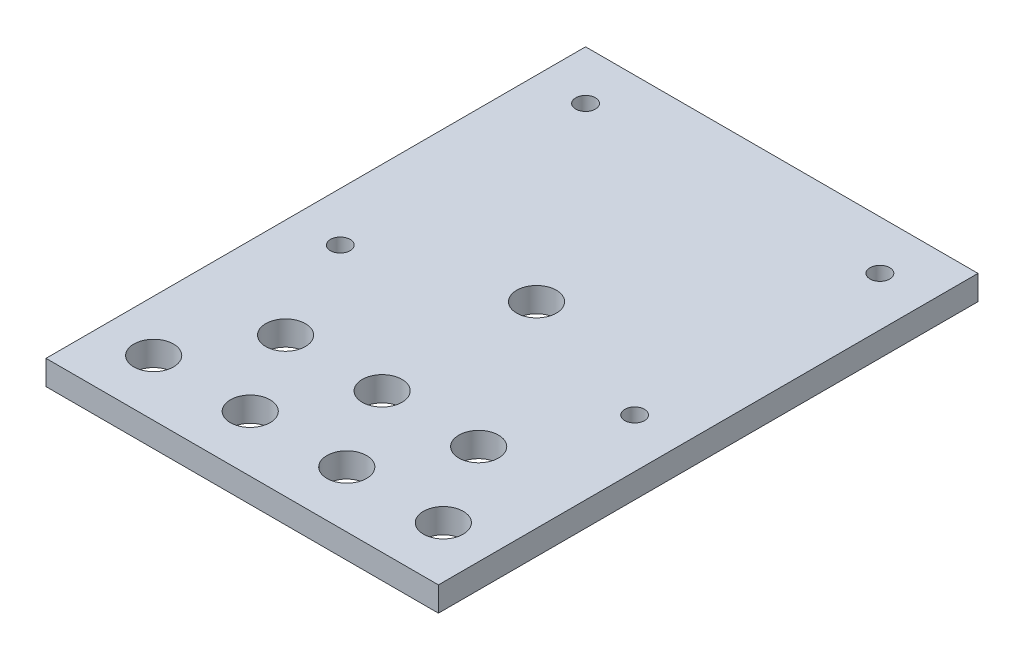
ISO-10303-21;
HEADER;
FILE_DESCRIPTION(('STEP AP214'),'2;1');
FILE_NAME('part.step','',(''),(''),'','','');
FILE_SCHEMA(('AUTOMOTIVE_DESIGN { 1 0 10303 214 1 1 1 1 }'));
ENDSEC;
DATA;
#1=APPLICATION_CONTEXT('core data for automotive mechanical design processes');
#2=APPLICATION_PROTOCOL_DEFINITION('international standard','automotive_design',2000,#1);
#3=PRODUCT_CONTEXT('',#1,'mechanical');
#4=PRODUCT('Part','Part','',(#3));
#5=PRODUCT_RELATED_PRODUCT_CATEGORY('part','',(#4));
#6=PRODUCT_DEFINITION_FORMATION('','',#4);
#7=PRODUCT_DEFINITION_CONTEXT('part definition',#1,'design');
#8=PRODUCT_DEFINITION('design','',#6,#7);
#9=PRODUCT_DEFINITION_SHAPE('','',#8);
#10=(LENGTH_UNIT() NAMED_UNIT(*) SI_UNIT(.MILLI.,.METRE.));
#11=(NAMED_UNIT(*) PLANE_ANGLE_UNIT() SI_UNIT($,.RADIAN.));
#12=(NAMED_UNIT(*) SI_UNIT($,.STERADIAN.) SOLID_ANGLE_UNIT());
#13=UNCERTAINTY_MEASURE_WITH_UNIT(LENGTH_MEASURE(1.E-05),#10,'distance_accuracy_value','');
#14=(GEOMETRIC_REPRESENTATION_CONTEXT(3) GLOBAL_UNCERTAINTY_ASSIGNED_CONTEXT((#13)) GLOBAL_UNIT_ASSIGNED_CONTEXT((#10,
#11,#12)) REPRESENTATION_CONTEXT('',''));
#15=CARTESIAN_POINT('',(0.,0.,0.));
#16=DIRECTION('',(0.,0.,1.));
#17=DIRECTION('',(1.,0.,0.));
#18=AXIS2_PLACEMENT_3D('',#15,#16,#17);
#19=CARTESIAN_POINT('',(0.,6.35,0.));
#20=DIRECTION('',(1.,0.,0.));
#21=DIRECTION('',(0.,0.,-1.));
#22=AXIS2_PLACEMENT_3D('',#19,#20,#21);
#23=PLANE('',#22);
#24=DIRECTION('',(0.,0.,1.));
#25=VECTOR('',#24,1.);
#26=CARTESIAN_POINT('',(0.,0.,0.));
#27=LINE('',#26,#25);
#28=CARTESIAN_POINT('',(0.,0.,-139.7));
#29=VERTEX_POINT('',#28);
#30=CARTESIAN_POINT('',(0.,0.,0.));
#31=VERTEX_POINT('',#30);
#32=EDGE_CURVE('E100',#29,#31,#27,.T.);
#33=ORIENTED_EDGE('',*,*,#32,.T.);
#34=DIRECTION('',(0.,-1.,0.));
#35=VECTOR('',#34,1.);
#36=CARTESIAN_POINT('',(0.,6.35,0.));
#37=LINE('',#36,#35);
#38=CARTESIAN_POINT('',(0.,6.35,0.));
#39=VERTEX_POINT('',#38);
#40=EDGE_CURVE('E11',#39,#31,#37,.T.);
#41=ORIENTED_EDGE('',*,*,#40,.F.);
#42=DIRECTION('',(0.,0.,1.));
#43=VECTOR('',#42,1.);
#44=CARTESIAN_POINT('',(0.,6.35,0.));
#45=LINE('',#44,#43);
#46=CARTESIAN_POINT('',(0.,6.35,-139.7));
#47=VERTEX_POINT('',#46);
#48=EDGE_CURVE('E88',#47,#39,#45,.T.);
#49=ORIENTED_EDGE('',*,*,#48,.F.);
#50=DIRECTION('',(0.,-1.,0.));
#51=VECTOR('',#50,1.);
#52=CARTESIAN_POINT('',(0.,6.35,-139.7));
#53=LINE('',#52,#51);
#54=EDGE_CURVE('E96',#47,#29,#53,.T.);
#55=ORIENTED_EDGE('',*,*,#54,.T.);
#56=EDGE_LOOP('',(#33,#41,#49,#55));
#57=FACE_BOUND('',#56,.T.);
#58=ADVANCED_FACE('F37',(#57),#23,.F.);
#59=CARTESIAN_POINT('',(0.,6.35,0.));
#60=DIRECTION('',(0.,0.,-1.));
#61=DIRECTION('',(-1.,0.,0.));
#62=AXIS2_PLACEMENT_3D('',#59,#60,#61);
#63=PLANE('',#62);
#64=DIRECTION('',(1.,0.,0.));
#65=VECTOR('',#64,1.);
#66=CARTESIAN_POINT('',(0.,0.,0.));
#67=LINE('',#66,#65);
#68=CARTESIAN_POINT('',(101.6,0.,0.));
#69=VERTEX_POINT('',#68);
#70=EDGE_CURVE('E92',#31,#69,#67,.T.);
#71=ORIENTED_EDGE('',*,*,#70,.T.);
#72=DIRECTION('',(0.,-1.,0.));
#73=VECTOR('',#72,1.);
#74=CARTESIAN_POINT('',(101.6,6.35,0.));
#75=LINE('',#74,#73);
#76=CARTESIAN_POINT('',(101.6,6.35,0.));
#77=VERTEX_POINT('',#76);
#78=EDGE_CURVE('E45',#77,#69,#75,.T.);
#79=ORIENTED_EDGE('',*,*,#78,.F.);
#80=DIRECTION('',(1.,0.,0.));
#81=VECTOR('',#80,1.);
#82=CARTESIAN_POINT('',(0.,6.35,0.));
#83=LINE('',#82,#81);
#84=EDGE_CURVE('E83',#39,#77,#83,.T.);
#85=ORIENTED_EDGE('',*,*,#84,.F.);
#86=ORIENTED_EDGE('',*,*,#40,.T.);
#87=EDGE_LOOP('',(#71,#79,#85,#86));
#88=FACE_BOUND('',#87,.T.);
#89=ADVANCED_FACE('F91',(#88),#63,.F.);
#90=CARTESIAN_POINT('',(101.6,6.35,0.));
#91=DIRECTION('',(-1.,0.,0.));
#92=DIRECTION('',(0.,0.,1.));
#93=AXIS2_PLACEMENT_3D('',#90,#91,#92);
#94=PLANE('',#93);
#95=DIRECTION('',(0.,0.,-1.));
#96=VECTOR('',#95,1.);
#97=CARTESIAN_POINT('',(101.6,0.,0.));
#98=LINE('',#97,#96);
#99=CARTESIAN_POINT('',(101.6,0.,-139.7));
#100=VERTEX_POINT('',#99);
#101=EDGE_CURVE('E70',#69,#100,#98,.T.);
#102=ORIENTED_EDGE('',*,*,#101,.T.);
#103=DIRECTION('',(0.,-1.,0.));
#104=VECTOR('',#103,1.);
#105=CARTESIAN_POINT('',(101.6,6.35,-139.7));
#106=LINE('',#105,#104);
#107=CARTESIAN_POINT('',(101.6,6.35,-139.7));
#108=VERTEX_POINT('',#107);
#109=EDGE_CURVE('E93',#108,#100,#106,.T.);
#110=ORIENTED_EDGE('',*,*,#109,.F.);
#111=DIRECTION('',(0.,0.,-1.));
#112=VECTOR('',#111,1.);
#113=CARTESIAN_POINT('',(101.6,6.35,0.));
#114=LINE('',#113,#112);
#115=EDGE_CURVE('E86',#77,#108,#114,.T.);
#116=ORIENTED_EDGE('',*,*,#115,.F.);
#117=ORIENTED_EDGE('',*,*,#78,.T.);
#118=EDGE_LOOP('',(#102,#110,#116,#117));
#119=FACE_BOUND('',#118,.T.);
#120=ADVANCED_FACE('F94',(#119),#94,.F.);
#121=CARTESIAN_POINT('',(0.,6.35,-139.7));
#122=DIRECTION('',(0.,0.,1.));
#123=DIRECTION('',(1.,0.,0.));
#124=AXIS2_PLACEMENT_3D('',#121,#122,#123);
#125=PLANE('',#124);
#126=DIRECTION('',(-1.,0.,0.));
#127=VECTOR('',#126,1.);
#128=CARTESIAN_POINT('',(0.,0.,-139.7));
#129=LINE('',#128,#127);
#130=EDGE_CURVE('E76',#100,#29,#129,.T.);
#131=ORIENTED_EDGE('',*,*,#130,.T.);
#132=ORIENTED_EDGE('',*,*,#54,.F.);
#133=DIRECTION('',(-1.,0.,0.));
#134=VECTOR('',#133,1.);
#135=CARTESIAN_POINT('',(0.,6.35,-139.7));
#136=LINE('',#135,#134);
#137=EDGE_CURVE('E53',#108,#47,#136,.T.);
#138=ORIENTED_EDGE('',*,*,#137,.F.);
#139=ORIENTED_EDGE('',*,*,#109,.T.);
#140=EDGE_LOOP('',(#131,#132,#138,#139));
#141=FACE_BOUND('',#140,.T.);
#142=ADVANCED_FACE('F108',(#141),#125,.F.);
#143=CARTESIAN_POINT('',(0.,6.35,0.));
#144=DIRECTION('',(0.,-1.,0.));
#145=DIRECTION('',(0.,0.,-1.));
#146=AXIS2_PLACEMENT_3D('',#143,#144,#145);
#147=PLANE('',#146);
#148=CARTESIAN_POINT('',(12.7,6.35,-127.));
#149=DIRECTION('',(0.,1.,0.));
#150=DIRECTION('',(0.,0.,1.));
#151=AXIS2_PLACEMENT_3D('',#148,#149,#150);
#152=CIRCLE('',#151,2.55);
#153=CARTESIAN_POINT('',(12.7,6.35,-124.45));
#154=VERTEX_POINT('',#153);
#155=EDGE_CURVE('E144',#154,#154,#152,.T.);
#156=ORIENTED_EDGE('',*,*,#155,.F.);
#157=EDGE_LOOP('',(#156));
#158=FACE_BOUND('',#157,.T.);
#159=CARTESIAN_POINT('',(12.7,6.35,-63.5));
#160=DIRECTION('',(0.,1.,0.));
#161=DIRECTION('',(0.,0.,1.));
#162=AXIS2_PLACEMENT_3D('',#159,#160,#161);
#163=CIRCLE('',#162,2.55);
#164=CARTESIAN_POINT('',(12.7,6.35,-60.95));
#165=VERTEX_POINT('',#164);
#166=EDGE_CURVE('E151',#165,#165,#163,.T.);
#167=ORIENTED_EDGE('',*,*,#166,.F.);
#168=EDGE_LOOP('',(#167));
#169=FACE_BOUND('',#168,.T.);
#170=CARTESIAN_POINT('',(25.8,6.35,-36.2253175473051));
#171=DIRECTION('',(0.,1.,0.));
#172=DIRECTION('',(0.,0.,1.));
#173=AXIS2_PLACEMENT_3D('',#170,#171,#172);
#174=CIRCLE('',#173,5.1435);
#175=CARTESIAN_POINT('',(25.8,6.35,-31.0818175473051));
#176=VERTEX_POINT('',#175);
#177=EDGE_CURVE('E157',#176,#176,#174,.T.);
#178=ORIENTED_EDGE('',*,*,#177,.F.);
#179=EDGE_LOOP('',(#178));
#180=FACE_BOUND('',#179,.T.);
#181=CARTESIAN_POINT('',(50.8,6.35,-36.2253175473055));
#182=DIRECTION('',(0.,1.,0.));
#183=DIRECTION('',(0.,0.,1.));
#184=AXIS2_PLACEMENT_3D('',#181,#182,#183);
#185=CIRCLE('',#184,5.14350000000001);
#186=CARTESIAN_POINT('',(50.8,6.35,-31.0818175473055));
#187=VERTEX_POINT('',#186);
#188=EDGE_CURVE('E163',#187,#187,#185,.T.);
#189=ORIENTED_EDGE('',*,*,#188,.F.);
#190=EDGE_LOOP('',(#189));
#191=FACE_BOUND('',#190,.T.);
#192=CARTESIAN_POINT('',(75.8,6.35,-36.2253175473055));
#193=DIRECTION('',(0.,1.,0.));
#194=DIRECTION('',(0.,0.,1.));
#195=AXIS2_PLACEMENT_3D('',#192,#193,#194);
#196=CIRCLE('',#195,5.1435);
#197=CARTESIAN_POINT('',(75.8,6.35,-31.0818175473055));
#198=VERTEX_POINT('',#197);
#199=EDGE_CURVE('E120',#198,#198,#196,.T.);
#200=ORIENTED_EDGE('',*,*,#199,.F.);
#201=EDGE_LOOP('',(#200));
#202=FACE_BOUND('',#201,.T.);
#203=CARTESIAN_POINT('',(88.3,6.35,-14.5746824526945));
#204=DIRECTION('',(0.,1.,0.));
#205=DIRECTION('',(0.,0.,1.));
#206=AXIS2_PLACEMENT_3D('',#203,#204,#205);
#207=CIRCLE('',#206,5.1435);
#208=CARTESIAN_POINT('',(88.3,6.35,-9.43118245269453));
#209=VERTEX_POINT('',#208);
#210=EDGE_CURVE('E127',#209,#209,#207,.T.);
#211=ORIENTED_EDGE('',*,*,#210,.F.);
#212=EDGE_LOOP('',(#211));
#213=FACE_BOUND('',#212,.T.);
#214=CARTESIAN_POINT('',(63.3,6.35,-14.5746824526945));
#215=DIRECTION('',(0.,1.,0.));
#216=DIRECTION('',(0.,0.,1.));
#217=AXIS2_PLACEMENT_3D('',#214,#215,#216);
#218=CIRCLE('',#217,5.1435);
#219=CARTESIAN_POINT('',(63.3,6.35,-9.43118245269453));
#220=VERTEX_POINT('',#219);
#221=EDGE_CURVE('E133',#220,#220,#218,.T.);
#222=ORIENTED_EDGE('',*,*,#221,.F.);
#223=EDGE_LOOP('',(#222));
#224=FACE_BOUND('',#223,.T.);
#225=CARTESIAN_POINT('',(38.3,6.35,-14.5746824526945));
#226=DIRECTION('',(0.,1.,0.));
#227=DIRECTION('',(0.,0.,1.));
#228=AXIS2_PLACEMENT_3D('',#225,#226,#227);
#229=CIRCLE('',#228,5.14350000000001);
#230=CARTESIAN_POINT('',(38.3,6.35,-9.43118245269452));
#231=VERTEX_POINT('',#230);
#232=EDGE_CURVE('E139',#231,#231,#229,.T.);
#233=ORIENTED_EDGE('',*,*,#232,.F.);
#234=EDGE_LOOP('',(#233));
#235=FACE_BOUND('',#234,.T.);
#236=CARTESIAN_POINT('',(88.9,6.35,-63.5));
#237=DIRECTION('',(0.,1.,0.));
#238=DIRECTION('',(0.,0.,1.));
#239=AXIS2_PLACEMENT_3D('',#236,#237,#238);
#240=CIRCLE('',#239,2.54999999999999);
#241=CARTESIAN_POINT('',(88.9,6.35,-60.95));
#242=VERTEX_POINT('',#241);
#243=EDGE_CURVE('E180',#242,#242,#240,.T.);
#244=ORIENTED_EDGE('',*,*,#243,.F.);
#245=EDGE_LOOP('',(#244));
#246=FACE_BOUND('',#245,.T.);
#247=CARTESIAN_POINT('',(88.9,6.35,-127.));
#248=DIRECTION('',(0.,1.,0.));
#249=DIRECTION('',(0.,0.,1.));
#250=AXIS2_PLACEMENT_3D('',#247,#248,#249);
#251=CIRCLE('',#250,2.54999999999999);
#252=CARTESIAN_POINT('',(88.9,6.35,-124.45));
#253=VERTEX_POINT('',#252);
#254=EDGE_CURVE('E174',#253,#253,#251,.T.);
#255=ORIENTED_EDGE('',*,*,#254,.F.);
#256=EDGE_LOOP('',(#255));
#257=FACE_BOUND('',#256,.T.);
#258=CARTESIAN_POINT('',(50.8,6.35,-76.1999999999997));
#259=DIRECTION('',(0.,1.,0.));
#260=DIRECTION('',(0.,0.,1.));
#261=AXIS2_PLACEMENT_3D('',#258,#259,#260);
#262=CIRCLE('',#261,5.14350000000008);
#263=CARTESIAN_POINT('',(50.8,6.35,-71.0564999999997));
#264=VERTEX_POINT('',#263);
#265=EDGE_CURVE('E168',#264,#264,#262,.T.);
#266=ORIENTED_EDGE('',*,*,#265,.F.);
#267=EDGE_LOOP('',(#266));
#268=FACE_BOUND('',#267,.T.);
#269=CARTESIAN_POINT('',(13.3,6.35,-14.5746824526945));
#270=DIRECTION('',(0.,1.,0.));
#271=DIRECTION('',(0.,0.,1.));
#272=AXIS2_PLACEMENT_3D('',#269,#270,#271);
#273=CIRCLE('',#272,5.1435);
#274=CARTESIAN_POINT('',(13.3,6.35,-9.43118245269452));
#275=VERTEX_POINT('',#274);
#276=EDGE_CURVE('E114',#275,#275,#273,.T.);
#277=ORIENTED_EDGE('',*,*,#276,.F.);
#278=EDGE_LOOP('',(#277));
#279=FACE_BOUND('',#278,.T.);
#280=ORIENTED_EDGE('',*,*,#48,.T.);
#281=ORIENTED_EDGE('',*,*,#84,.T.);
#282=ORIENTED_EDGE('',*,*,#115,.T.);
#283=ORIENTED_EDGE('',*,*,#137,.T.);
#284=EDGE_LOOP('',(#280,#281,#282,#283));
#285=FACE_BOUND('',#284,.T.);
#286=ADVANCED_FACE('F84',(#158,#169,#180,#191,#202,#213,#224,#235,#246,#257,#268,#279,#285),
#147,.F.);
#287=CARTESIAN_POINT('',(0.,0.,0.));
#288=DIRECTION('',(0.,-1.,0.));
#289=DIRECTION('',(0.,0.,-1.));
#290=AXIS2_PLACEMENT_3D('',#287,#288,#289);
#291=PLANE('',#290);
#292=CARTESIAN_POINT('',(12.7,0.,-127.));
#293=DIRECTION('',(0.,1.,0.));
#294=DIRECTION('',(0.,0.,1.));
#295=AXIS2_PLACEMENT_3D('',#292,#293,#294);
#296=CIRCLE('',#295,2.55);
#297=CARTESIAN_POINT('',(12.7,0.,-124.45));
#298=VERTEX_POINT('',#297);
#299=EDGE_CURVE('E147',#298,#298,#296,.T.);
#300=ORIENTED_EDGE('',*,*,#299,.T.);
#301=EDGE_LOOP('',(#300));
#302=FACE_BOUND('',#301,.T.);
#303=CARTESIAN_POINT('',(12.7,0.,-63.5));
#304=DIRECTION('',(0.,1.,0.));
#305=DIRECTION('',(0.,0.,1.));
#306=AXIS2_PLACEMENT_3D('',#303,#304,#305);
#307=CIRCLE('',#306,2.55);
#308=CARTESIAN_POINT('',(12.7,0.,-60.95));
#309=VERTEX_POINT('',#308);
#310=EDGE_CURVE('E154',#309,#309,#307,.T.);
#311=ORIENTED_EDGE('',*,*,#310,.T.);
#312=EDGE_LOOP('',(#311));
#313=FACE_BOUND('',#312,.T.);
#314=CARTESIAN_POINT('',(25.8,0.,-36.2253175473051));
#315=DIRECTION('',(0.,1.,0.));
#316=DIRECTION('',(0.,0.,1.));
#317=AXIS2_PLACEMENT_3D('',#314,#315,#316);
#318=CIRCLE('',#317,5.1435);
#319=CARTESIAN_POINT('',(25.8,0.,-31.0818175473051));
#320=VERTEX_POINT('',#319);
#321=EDGE_CURVE('E160',#320,#320,#318,.T.);
#322=ORIENTED_EDGE('',*,*,#321,.T.);
#323=EDGE_LOOP('',(#322));
#324=FACE_BOUND('',#323,.T.);
#325=CARTESIAN_POINT('',(50.8,0.,-36.2253175473055));
#326=DIRECTION('',(0.,1.,0.));
#327=DIRECTION('',(0.,0.,1.));
#328=AXIS2_PLACEMENT_3D('',#325,#326,#327);
#329=CIRCLE('',#328,5.14350000000001);
#330=CARTESIAN_POINT('',(50.8,0.,-31.0818175473055));
#331=VERTEX_POINT('',#330);
#332=EDGE_CURVE('E124',#331,#331,#329,.T.);
#333=ORIENTED_EDGE('',*,*,#332,.T.);
#334=EDGE_LOOP('',(#333));
#335=FACE_BOUND('',#334,.T.);
#336=CARTESIAN_POINT('',(75.8,0.,-36.2253175473055));
#337=DIRECTION('',(0.,1.,0.));
#338=DIRECTION('',(0.,0.,1.));
#339=AXIS2_PLACEMENT_3D('',#336,#337,#338);
#340=CIRCLE('',#339,5.1435);
#341=CARTESIAN_POINT('',(75.8,0.,-31.0818175473055));
#342=VERTEX_POINT('',#341);
#343=EDGE_CURVE('E123',#342,#342,#340,.T.);
#344=ORIENTED_EDGE('',*,*,#343,.T.);
#345=EDGE_LOOP('',(#344));
#346=FACE_BOUND('',#345,.T.);
#347=CARTESIAN_POINT('',(88.3,0.,-14.5746824526945));
#348=DIRECTION('',(0.,1.,0.));
#349=DIRECTION('',(0.,0.,1.));
#350=AXIS2_PLACEMENT_3D('',#347,#348,#349);
#351=CIRCLE('',#350,5.1435);
#352=CARTESIAN_POINT('',(88.3,0.,-9.43118245269453));
#353=VERTEX_POINT('',#352);
#354=EDGE_CURVE('E130',#353,#353,#351,.T.);
#355=ORIENTED_EDGE('',*,*,#354,.T.);
#356=EDGE_LOOP('',(#355));
#357=FACE_BOUND('',#356,.T.);
#358=CARTESIAN_POINT('',(63.3,0.,-14.5746824526945));
#359=DIRECTION('',(0.,1.,0.));
#360=DIRECTION('',(0.,0.,1.));
#361=AXIS2_PLACEMENT_3D('',#358,#359,#360);
#362=CIRCLE('',#361,5.1435);
#363=CARTESIAN_POINT('',(63.3,0.,-9.43118245269453));
#364=VERTEX_POINT('',#363);
#365=EDGE_CURVE('E136',#364,#364,#362,.T.);
#366=ORIENTED_EDGE('',*,*,#365,.T.);
#367=EDGE_LOOP('',(#366));
#368=FACE_BOUND('',#367,.T.);
#369=CARTESIAN_POINT('',(38.3,0.,-14.5746824526945));
#370=DIRECTION('',(0.,1.,0.));
#371=DIRECTION('',(0.,0.,1.));
#372=AXIS2_PLACEMENT_3D('',#369,#370,#371);
#373=CIRCLE('',#372,5.14350000000001);
#374=CARTESIAN_POINT('',(38.3,0.,-9.43118245269452));
#375=VERTEX_POINT('',#374);
#376=EDGE_CURVE('E117',#375,#375,#373,.T.);
#377=ORIENTED_EDGE('',*,*,#376,.T.);
#378=EDGE_LOOP('',(#377));
#379=FACE_BOUND('',#378,.T.);
#380=CARTESIAN_POINT('',(88.9,0.,-63.5));
#381=DIRECTION('',(0.,1.,0.));
#382=DIRECTION('',(0.,0.,1.));
#383=AXIS2_PLACEMENT_3D('',#380,#381,#382);
#384=CIRCLE('',#383,2.54999999999999);
#385=CARTESIAN_POINT('',(88.9,0.,-60.95));
#386=VERTEX_POINT('',#385);
#387=EDGE_CURVE('E148',#386,#386,#384,.T.);
#388=ORIENTED_EDGE('',*,*,#387,.T.);
#389=EDGE_LOOP('',(#388));
#390=FACE_BOUND('',#389,.T.);
#391=CARTESIAN_POINT('',(88.9,0.,-127.));
#392=DIRECTION('',(0.,1.,0.));
#393=DIRECTION('',(0.,0.,1.));
#394=AXIS2_PLACEMENT_3D('',#391,#392,#393);
#395=CIRCLE('',#394,2.54999999999999);
#396=CARTESIAN_POINT('',(88.9,0.,-124.45));
#397=VERTEX_POINT('',#396);
#398=EDGE_CURVE('E177',#397,#397,#395,.T.);
#399=ORIENTED_EDGE('',*,*,#398,.T.);
#400=EDGE_LOOP('',(#399));
#401=FACE_BOUND('',#400,.T.);
#402=CARTESIAN_POINT('',(50.8,0.,-76.1999999999997));
#403=DIRECTION('',(0.,1.,0.));
#404=DIRECTION('',(0.,0.,1.));
#405=AXIS2_PLACEMENT_3D('',#402,#403,#404);
#406=CIRCLE('',#405,5.14350000000008);
#407=CARTESIAN_POINT('',(50.8,0.,-71.0564999999997));
#408=VERTEX_POINT('',#407);
#409=EDGE_CURVE('E171',#408,#408,#406,.T.);
#410=ORIENTED_EDGE('',*,*,#409,.T.);
#411=EDGE_LOOP('',(#410));
#412=FACE_BOUND('',#411,.T.);
#413=CARTESIAN_POINT('',(13.3,0.,-14.5746824526945));
#414=DIRECTION('',(0.,1.,0.));
#415=DIRECTION('',(0.,0.,1.));
#416=AXIS2_PLACEMENT_3D('',#413,#414,#415);
#417=CIRCLE('',#416,5.1435);
#418=CARTESIAN_POINT('',(13.3,0.,-9.43118245269452));
#419=VERTEX_POINT('',#418);
#420=EDGE_CURVE('E103',#419,#419,#417,.T.);
#421=ORIENTED_EDGE('',*,*,#420,.T.);
#422=EDGE_LOOP('',(#421));
#423=FACE_BOUND('',#422,.T.);
#424=ORIENTED_EDGE('',*,*,#32,.F.);
#425=ORIENTED_EDGE('',*,*,#130,.F.);
#426=ORIENTED_EDGE('',*,*,#101,.F.);
#427=ORIENTED_EDGE('',*,*,#70,.F.);
#428=EDGE_LOOP('',(#424,#425,#426,#427));
#429=FACE_BOUND('',#428,.T.);
#430=ADVANCED_FACE('F111',(#302,#313,#324,#335,#346,#357,#368,#379,#390,#401,#412,#423,#429),
#291,.T.);
#431=CARTESIAN_POINT('',(13.3,0.,-14.5746824526945));
#432=DIRECTION('',(0.,1.,0.));
#433=DIRECTION('',(0.,0.,1.));
#434=AXIS2_PLACEMENT_3D('',#431,#432,#433);
#435=CYLINDRICAL_SURFACE('',#434,5.1435);
#436=ORIENTED_EDGE('',*,*,#420,.F.);
#437=EDGE_LOOP('',(#436));
#438=FACE_BOUND('',#437,.T.);
#439=ORIENTED_EDGE('',*,*,#276,.T.);
#440=EDGE_LOOP('',(#439));
#441=FACE_BOUND('',#440,.T.);
#442=ADVANCED_FACE('F206',(#438,#441),#435,.F.);
#443=CARTESIAN_POINT('',(50.8,0.,-76.1999999999997));
#444=DIRECTION('',(0.,1.,0.));
#445=DIRECTION('',(0.,0.,1.));
#446=AXIS2_PLACEMENT_3D('',#443,#444,#445);
#447=CYLINDRICAL_SURFACE('',#446,5.14350000000008);
#448=ORIENTED_EDGE('',*,*,#409,.F.);
#449=EDGE_LOOP('',(#448));
#450=FACE_BOUND('',#449,.T.);
#451=ORIENTED_EDGE('',*,*,#265,.T.);
#452=EDGE_LOOP('',(#451));
#453=FACE_BOUND('',#452,.T.);
#454=ADVANCED_FACE('F208',(#450,#453),#447,.F.);
#455=CARTESIAN_POINT('',(88.9,0.,-127.));
#456=DIRECTION('',(0.,1.,0.));
#457=DIRECTION('',(0.,0.,1.));
#458=AXIS2_PLACEMENT_3D('',#455,#456,#457);
#459=CYLINDRICAL_SURFACE('',#458,2.54999999999999);
#460=ORIENTED_EDGE('',*,*,#398,.F.);
#461=EDGE_LOOP('',(#460));
#462=FACE_BOUND('',#461,.T.);
#463=ORIENTED_EDGE('',*,*,#254,.T.);
#464=EDGE_LOOP('',(#463));
#465=FACE_BOUND('',#464,.T.);
#466=ADVANCED_FACE('F192',(#462,#465),#459,.F.);
#467=CARTESIAN_POINT('',(88.9,0.,-63.5));
#468=DIRECTION('',(0.,1.,0.));
#469=DIRECTION('',(0.,0.,1.));
#470=AXIS2_PLACEMENT_3D('',#467,#468,#469);
#471=CYLINDRICAL_SURFACE('',#470,2.54999999999999);
#472=ORIENTED_EDGE('',*,*,#387,.F.);
#473=EDGE_LOOP('',(#472));
#474=FACE_BOUND('',#473,.T.);
#475=ORIENTED_EDGE('',*,*,#243,.T.);
#476=EDGE_LOOP('',(#475));
#477=FACE_BOUND('',#476,.T.);
#478=ADVANCED_FACE('F188',(#474,#477),#471,.F.);
#479=CARTESIAN_POINT('',(38.3,0.,-14.5746824526945));
#480=DIRECTION('',(0.,1.,0.));
#481=DIRECTION('',(0.,0.,1.));
#482=AXIS2_PLACEMENT_3D('',#479,#480,#481);
#483=CYLINDRICAL_SURFACE('',#482,5.14350000000001);
#484=ORIENTED_EDGE('',*,*,#376,.F.);
#485=EDGE_LOOP('',(#484));
#486=FACE_BOUND('',#485,.T.);
#487=ORIENTED_EDGE('',*,*,#232,.T.);
#488=EDGE_LOOP('',(#487));
#489=FACE_BOUND('',#488,.T.);
#490=ADVANCED_FACE('F191',(#486,#489),#483,.F.);
#491=CARTESIAN_POINT('',(63.3,0.,-14.5746824526945));
#492=DIRECTION('',(0.,1.,0.));
#493=DIRECTION('',(0.,0.,1.));
#494=AXIS2_PLACEMENT_3D('',#491,#492,#493);
#495=CYLINDRICAL_SURFACE('',#494,5.1435);
#496=ORIENTED_EDGE('',*,*,#365,.F.);
#497=EDGE_LOOP('',(#496));
#498=FACE_BOUND('',#497,.T.);
#499=ORIENTED_EDGE('',*,*,#221,.T.);
#500=EDGE_LOOP('',(#499));
#501=FACE_BOUND('',#500,.T.);
#502=ADVANCED_FACE('F277',(#498,#501),#495,.F.);
#503=CARTESIAN_POINT('',(88.3,0.,-14.5746824526945));
#504=DIRECTION('',(0.,1.,0.));
#505=DIRECTION('',(0.,0.,1.));
#506=AXIS2_PLACEMENT_3D('',#503,#504,#505);
#507=CYLINDRICAL_SURFACE('',#506,5.1435);
#508=ORIENTED_EDGE('',*,*,#354,.F.);
#509=EDGE_LOOP('',(#508));
#510=FACE_BOUND('',#509,.T.);
#511=ORIENTED_EDGE('',*,*,#210,.T.);
#512=EDGE_LOOP('',(#511));
#513=FACE_BOUND('',#512,.T.);
#514=ADVANCED_FACE('F287',(#510,#513),#507,.F.);
#515=CARTESIAN_POINT('',(75.8,0.,-36.2253175473055));
#516=DIRECTION('',(0.,1.,0.));
#517=DIRECTION('',(0.,0.,1.));
#518=AXIS2_PLACEMENT_3D('',#515,#516,#517);
#519=CYLINDRICAL_SURFACE('',#518,5.1435);
#520=ORIENTED_EDGE('',*,*,#343,.F.);
#521=EDGE_LOOP('',(#520));
#522=FACE_BOUND('',#521,.T.);
#523=ORIENTED_EDGE('',*,*,#199,.T.);
#524=EDGE_LOOP('',(#523));
#525=FACE_BOUND('',#524,.T.);
#526=ADVANCED_FACE('F297',(#522,#525),#519,.F.);
#527=CARTESIAN_POINT('',(50.8,0.,-36.2253175473055));
#528=DIRECTION('',(0.,1.,0.));
#529=DIRECTION('',(0.,0.,1.));
#530=AXIS2_PLACEMENT_3D('',#527,#528,#529);
#531=CYLINDRICAL_SURFACE('',#530,5.14350000000001);
#532=ORIENTED_EDGE('',*,*,#332,.F.);
#533=EDGE_LOOP('',(#532));
#534=FACE_BOUND('',#533,.T.);
#535=ORIENTED_EDGE('',*,*,#188,.T.);
#536=EDGE_LOOP('',(#535));
#537=FACE_BOUND('',#536,.T.);
#538=ADVANCED_FACE('F307',(#534,#537),#531,.F.);
#539=CARTESIAN_POINT('',(25.8,0.,-36.2253175473051));
#540=DIRECTION('',(0.,1.,0.));
#541=DIRECTION('',(0.,0.,1.));
#542=AXIS2_PLACEMENT_3D('',#539,#540,#541);
#543=CYLINDRICAL_SURFACE('',#542,5.1435);
#544=ORIENTED_EDGE('',*,*,#321,.F.);
#545=EDGE_LOOP('',(#544));
#546=FACE_BOUND('',#545,.T.);
#547=ORIENTED_EDGE('',*,*,#177,.T.);
#548=EDGE_LOOP('',(#547));
#549=FACE_BOUND('',#548,.T.);
#550=ADVANCED_FACE('F316',(#546,#549),#543,.F.);
#551=CARTESIAN_POINT('',(12.7,0.,-63.5));
#552=DIRECTION('',(0.,1.,0.));
#553=DIRECTION('',(0.,0.,1.));
#554=AXIS2_PLACEMENT_3D('',#551,#552,#553);
#555=CYLINDRICAL_SURFACE('',#554,2.55);
#556=ORIENTED_EDGE('',*,*,#310,.F.);
#557=EDGE_LOOP('',(#556));
#558=FACE_BOUND('',#557,.T.);
#559=ORIENTED_EDGE('',*,*,#166,.T.);
#560=EDGE_LOOP('',(#559));
#561=FACE_BOUND('',#560,.T.);
#562=ADVANCED_FACE('F326',(#558,#561),#555,.F.);
#563=CARTESIAN_POINT('',(12.7,0.,-127.));
#564=DIRECTION('',(0.,1.,0.));
#565=DIRECTION('',(0.,0.,1.));
#566=AXIS2_PLACEMENT_3D('',#563,#564,#565);
#567=CYLINDRICAL_SURFACE('',#566,2.55);
#568=ORIENTED_EDGE('',*,*,#299,.F.);
#569=EDGE_LOOP('',(#568));
#570=FACE_BOUND('',#569,.T.);
#571=ORIENTED_EDGE('',*,*,#155,.T.);
#572=EDGE_LOOP('',(#571));
#573=FACE_BOUND('',#572,.T.);
#574=ADVANCED_FACE('F336',(#570,#573),#567,.F.);
#575=CLOSED_SHELL('',(#58,#89,#120,#142,#286,#430,#442,#454,#466,#478,#490,#502,#514,#526,#538,
#550,#562,#574));
#576=MANIFOLD_SOLID_BREP('B2',#575);
#577=ADVANCED_BREP_SHAPE_REPRESENTATION('',(#18,#576),#14);
#578=SHAPE_DEFINITION_REPRESENTATION(#9,#577);
ENDSEC;
END-ISO-10303-21;
